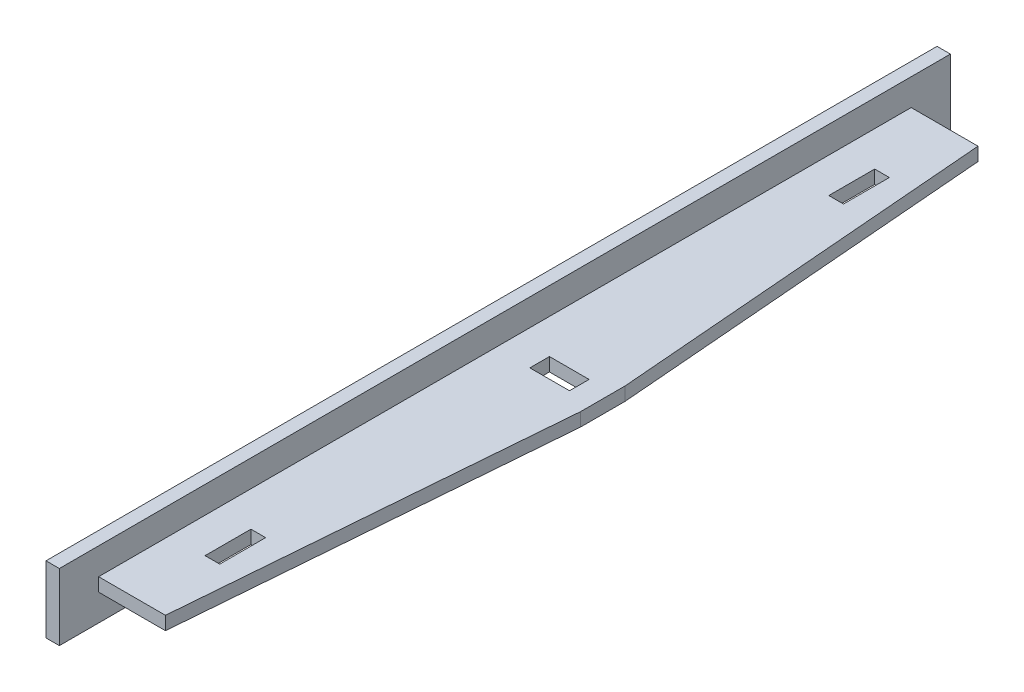
ISO-10303-21;
HEADER;
FILE_DESCRIPTION(('STEP AP214'),'2;1');
FILE_NAME('part.step','',(''),(''),'','','');
FILE_SCHEMA(('AUTOMOTIVE_DESIGN { 1 0 10303 214 1 1 1 1 }'));
ENDSEC;
DATA;
#1=APPLICATION_CONTEXT('core data for automotive mechanical design processes');
#2=APPLICATION_PROTOCOL_DEFINITION('international standard','automotive_design',2000,#1);
#3=PRODUCT_CONTEXT('',#1,'mechanical');
#4=PRODUCT('Part','Part','',(#3));
#5=PRODUCT_RELATED_PRODUCT_CATEGORY('part','',(#4));
#6=PRODUCT_DEFINITION_FORMATION('','',#4);
#7=PRODUCT_DEFINITION_CONTEXT('part definition',#1,'design');
#8=PRODUCT_DEFINITION('design','',#6,#7);
#9=PRODUCT_DEFINITION_SHAPE('','',#8);
#10=(LENGTH_UNIT() NAMED_UNIT(*) SI_UNIT(.MILLI.,.METRE.));
#11=(NAMED_UNIT(*) PLANE_ANGLE_UNIT() SI_UNIT($,.RADIAN.));
#12=(NAMED_UNIT(*) SI_UNIT($,.STERADIAN.) SOLID_ANGLE_UNIT());
#13=UNCERTAINTY_MEASURE_WITH_UNIT(LENGTH_MEASURE(1.E-05),#10,'distance_accuracy_value','');
#14=(GEOMETRIC_REPRESENTATION_CONTEXT(3) GLOBAL_UNCERTAINTY_ASSIGNED_CONTEXT((#13)) GLOBAL_UNIT_ASSIGNED_CONTEXT((#10,
#11,#12)) REPRESENTATION_CONTEXT('',''));
#15=CARTESIAN_POINT('',(0.,0.,0.));
#16=DIRECTION('',(0.,0.,1.));
#17=DIRECTION('',(1.,0.,0.));
#18=AXIS2_PLACEMENT_3D('',#15,#16,#17);
#19=CARTESIAN_POINT('',(0.,6.,0.));
#20=DIRECTION('',(0.,1.,0.));
#21=DIRECTION('',(0.,0.,1.));
#22=AXIS2_PLACEMENT_3D('',#19,#20,#21);
#23=PLANE('',#22);
#24=DIRECTION('',(0.,0.,1.));
#25=VECTOR('',#24,1.);
#26=CARTESIAN_POINT('',(10.85,6.,0.));
#27=LINE('',#26,#25);
#28=CARTESIAN_POINT('',(10.85,6.,164.849983771439));
#29=VERTEX_POINT('',#28);
#30=CARTESIAN_POINT('',(10.85,6.,175.149983771439));
#31=VERTEX_POINT('',#30);
#32=EDGE_CURVE('E66',#29,#31,#27,.T.);
#33=ORIENTED_EDGE('',*,*,#32,.T.);
#34=DIRECTION('',(1.,0.,0.));
#35=VECTOR('',#34,1.);
#36=CARTESIAN_POINT('',(0.,6.,175.149983771439));
#37=LINE('',#36,#35);
#38=CARTESIAN_POINT('',(14.15,6.,175.149983771439));
#39=VERTEX_POINT('',#38);
#40=EDGE_CURVE('E226',#31,#39,#37,.T.);
#41=ORIENTED_EDGE('',*,*,#40,.T.);
#42=DIRECTION('',(0.,0.,1.));
#43=VECTOR('',#42,1.);
#44=CARTESIAN_POINT('',(14.15,6.,0.));
#45=LINE('',#44,#43);
#46=CARTESIAN_POINT('',(14.15,6.,164.849983771439));
#47=VERTEX_POINT('',#46);
#48=EDGE_CURVE('E236',#47,#39,#45,.T.);
#49=ORIENTED_EDGE('',*,*,#48,.F.);
#50=DIRECTION('',(1.,0.,0.));
#51=VECTOR('',#50,1.);
#52=CARTESIAN_POINT('',(0.,6.,164.849983771439));
#53=LINE('',#52,#51);
#54=EDGE_CURVE('E239',#29,#47,#53,.T.);
#55=ORIENTED_EDGE('',*,*,#54,.F.);
#56=EDGE_LOOP('',(#33,#41,#49,#55));
#57=FACE_BOUND('',#56,.T.);
#58=DIRECTION('',(1.,0.,0.));
#59=VECTOR('',#58,1.);
#60=CARTESIAN_POINT('',(10.8,6.,97.7999837714389));
#61=LINE('',#60,#59);
#62=CARTESIAN_POINT('',(10.8,6.,97.7999837714389));
#63=VERTEX_POINT('',#62);
#64=CARTESIAN_POINT('',(19.7,6.,97.7999837714389));
#65=VERTEX_POINT('',#64);
#66=EDGE_CURVE('E258',#63,#65,#61,.T.);
#67=ORIENTED_EDGE('',*,*,#66,.F.);
#68=DIRECTION('',(0.,0.,-1.));
#69=VECTOR('',#68,1.);
#70=CARTESIAN_POINT('',(10.8,6.,102.199983771439));
#71=LINE('',#70,#69);
#72=CARTESIAN_POINT('',(10.8,6.,102.199983771439));
#73=VERTEX_POINT('',#72);
#74=EDGE_CURVE('E233',#73,#63,#71,.T.);
#75=ORIENTED_EDGE('',*,*,#74,.F.);
#76=DIRECTION('',(1.,0.,0.));
#77=VECTOR('',#76,1.);
#78=CARTESIAN_POINT('',(10.8,6.,102.199983771439));
#79=LINE('',#78,#77);
#80=CARTESIAN_POINT('',(19.7,6.,102.199983771439));
#81=VERTEX_POINT('',#80);
#82=EDGE_CURVE('E246',#73,#81,#79,.T.);
#83=ORIENTED_EDGE('',*,*,#82,.T.);
#84=DIRECTION('',(0.,0.,-1.));
#85=VECTOR('',#84,1.);
#86=CARTESIAN_POINT('',(19.7,6.,102.199983771439));
#87=LINE('',#86,#85);
#88=EDGE_CURVE('E255',#81,#65,#87,.T.);
#89=ORIENTED_EDGE('',*,*,#88,.T.);
#90=EDGE_LOOP('',(#67,#75,#83,#89));
#91=FACE_BOUND('',#90,.T.);
#92=DIRECTION('',(0.,0.,1.));
#93=VECTOR('',#92,1.);
#94=CARTESIAN_POINT('',(3.,6.,8.80998377143878));
#95=LINE('',#94,#93);
#96=CARTESIAN_POINT('',(3.,6.,8.80998377143878));
#97=VERTEX_POINT('',#96);
#98=CARTESIAN_POINT('',(3.,6.,191.190016228561));
#99=VERTEX_POINT('',#98);
#100=EDGE_CURVE('E262',#97,#99,#95,.T.);
#101=ORIENTED_EDGE('',*,*,#100,.F.);
#102=DIRECTION('',(-1.,0.,0.));
#103=VECTOR('',#102,1.);
#104=CARTESIAN_POINT('',(3.,6.,8.80998377143878));
#105=LINE('',#104,#103);
#106=CARTESIAN_POINT('',(18.,6.,8.80998377143878));
#107=VERTEX_POINT('',#106);
#108=EDGE_CURVE('E278',#107,#97,#105,.T.);
#109=ORIENTED_EDGE('',*,*,#108,.F.);
#110=DIRECTION('',(-0.0809493698714183,0.,-0.996718214701337));
#111=VECTOR('',#110,1.);
#112=CARTESIAN_POINT('',(18.,6.,8.80998377143878));
#113=LINE('',#112,#111);
#114=CARTESIAN_POINT('',(25.,6.,95.));
#115=VERTEX_POINT('',#114);
#116=EDGE_CURVE('E275',#115,#107,#113,.T.);
#117=ORIENTED_EDGE('',*,*,#116,.F.);
#118=DIRECTION('',(0.,0.,-1.));
#119=VECTOR('',#118,1.);
#120=CARTESIAN_POINT('',(25.,6.,95.));
#121=LINE('',#120,#119);
#122=CARTESIAN_POINT('',(25.,6.,105.));
#123=VERTEX_POINT('',#122);
#124=EDGE_CURVE('E272',#123,#115,#121,.T.);
#125=ORIENTED_EDGE('',*,*,#124,.F.);
#126=DIRECTION('',(0.0809493698714183,0.,-0.996718214701337));
#127=VECTOR('',#126,1.);
#128=CARTESIAN_POINT('',(18.,6.,191.190016228561));
#129=LINE('',#128,#127);
#130=CARTESIAN_POINT('',(18.,6.,191.190016228561));
#131=VERTEX_POINT('',#130);
#132=EDGE_CURVE('E269',#131,#123,#129,.T.);
#133=ORIENTED_EDGE('',*,*,#132,.F.);
#134=DIRECTION('',(1.,0.,0.));
#135=VECTOR('',#134,1.);
#136=CARTESIAN_POINT('',(3.,6.,191.190016228561));
#137=LINE('',#136,#135);
#138=EDGE_CURVE('E265',#99,#131,#137,.T.);
#139=ORIENTED_EDGE('',*,*,#138,.F.);
#140=EDGE_LOOP('',(#101,#109,#117,#125,#133,#139));
#141=FACE_BOUND('',#140,.T.);
#142=DIRECTION('',(0.,0.,-1.));
#143=VECTOR('',#142,1.);
#144=CARTESIAN_POINT('',(14.15,6.,0.));
#145=LINE('',#144,#143);
#146=CARTESIAN_POINT('',(14.15,6.,35.1499837714388));
#147=VERTEX_POINT('',#146);
#148=CARTESIAN_POINT('',(14.15,6.,24.8499837714389));
#149=VERTEX_POINT('',#148);
#150=EDGE_CURVE('E58',#147,#149,#145,.T.);
#151=ORIENTED_EDGE('',*,*,#150,.T.);
#152=DIRECTION('',(1.,0.,0.));
#153=VECTOR('',#152,1.);
#154=CARTESIAN_POINT('',(0.,6.,24.8499837714389));
#155=LINE('',#154,#153);
#156=CARTESIAN_POINT('',(10.85,6.,24.8499837714389));
#157=VERTEX_POINT('',#156);
#158=EDGE_CURVE('E214',#157,#149,#155,.T.);
#159=ORIENTED_EDGE('',*,*,#158,.F.);
#160=DIRECTION('',(0.,0.,-1.));
#161=VECTOR('',#160,1.);
#162=CARTESIAN_POINT('',(10.85,6.,0.));
#163=LINE('',#162,#161);
#164=CARTESIAN_POINT('',(10.85,6.,35.1499837714388));
#165=VERTEX_POINT('',#164);
#166=EDGE_CURVE('E199',#165,#157,#163,.T.);
#167=ORIENTED_EDGE('',*,*,#166,.F.);
#168=DIRECTION('',(1.,0.,0.));
#169=VECTOR('',#168,1.);
#170=CARTESIAN_POINT('',(0.,6.,35.1499837714388));
#171=LINE('',#170,#169);
#172=EDGE_CURVE('E209',#165,#147,#171,.T.);
#173=ORIENTED_EDGE('',*,*,#172,.T.);
#174=EDGE_LOOP('',(#151,#159,#167,#173));
#175=FACE_BOUND('',#174,.T.);
#176=ADVANCED_FACE('F43',(#57,#91,#141,#175),#23,.F.);
#177=CARTESIAN_POINT('',(0.,9.,0.));
#178=DIRECTION('',(0.,1.,0.));
#179=DIRECTION('',(0.,0.,1.));
#180=AXIS2_PLACEMENT_3D('',#177,#178,#179);
#181=PLANE('',#180);
#182=DIRECTION('',(0.,0.,1.));
#183=VECTOR('',#182,1.);
#184=CARTESIAN_POINT('',(10.8,9.,0.));
#185=LINE('',#184,#183);
#186=CARTESIAN_POINT('',(10.8,9.,97.7999837714389));
#187=VERTEX_POINT('',#186);
#188=CARTESIAN_POINT('',(10.8,9.,102.199983771439));
#189=VERTEX_POINT('',#188);
#190=EDGE_CURVE('E347',#187,#189,#185,.T.);
#191=ORIENTED_EDGE('',*,*,#190,.F.);
#192=DIRECTION('',(-1.,0.,0.));
#193=VECTOR('',#192,1.);
#194=CARTESIAN_POINT('',(0.,9.,97.7999837714389));
#195=LINE('',#194,#193);
#196=CARTESIAN_POINT('',(19.7,9.,97.7999837714389));
#197=VERTEX_POINT('',#196);
#198=EDGE_CURVE('E339',#197,#187,#195,.T.);
#199=ORIENTED_EDGE('',*,*,#198,.F.);
#200=DIRECTION('',(0.,0.,1.));
#201=VECTOR('',#200,1.);
#202=CARTESIAN_POINT('',(19.7,9.,0.));
#203=LINE('',#202,#201);
#204=CARTESIAN_POINT('',(19.7,9.,102.199983771439));
#205=VERTEX_POINT('',#204);
#206=EDGE_CURVE('E341',#197,#205,#203,.T.);
#207=ORIENTED_EDGE('',*,*,#206,.T.);
#208=DIRECTION('',(-1.,0.,0.));
#209=VECTOR('',#208,1.);
#210=CARTESIAN_POINT('',(0.,9.,102.199983771439));
#211=LINE('',#210,#209);
#212=EDGE_CURVE('E344',#205,#189,#211,.T.);
#213=ORIENTED_EDGE('',*,*,#212,.T.);
#214=EDGE_LOOP('',(#191,#199,#207,#213));
#215=FACE_BOUND('',#214,.T.);
#216=DIRECTION('',(0.,0.,1.));
#217=VECTOR('',#216,1.);
#218=CARTESIAN_POINT('',(3.,9.,8.80998377143878));
#219=LINE('',#218,#217);
#220=CARTESIAN_POINT('',(3.,9.,8.80998377143878));
#221=VERTEX_POINT('',#220);
#222=CARTESIAN_POINT('',(3.,9.,191.190016228561));
#223=VERTEX_POINT('',#222);
#224=EDGE_CURVE('E221',#221,#223,#219,.T.);
#225=ORIENTED_EDGE('',*,*,#224,.T.);
#226=DIRECTION('',(1.,0.,0.));
#227=VECTOR('',#226,1.);
#228=CARTESIAN_POINT('',(3.,9.,191.190016228561));
#229=LINE('',#228,#227);
#230=CARTESIAN_POINT('',(18.,9.,191.190016228561));
#231=VERTEX_POINT('',#230);
#232=EDGE_CURVE('E283',#223,#231,#229,.T.);
#233=ORIENTED_EDGE('',*,*,#232,.T.);
#234=DIRECTION('',(0.0809493698714183,0.,-0.996718214701337));
#235=VECTOR('',#234,1.);
#236=CARTESIAN_POINT('',(18.,9.,191.190016228561));
#237=LINE('',#236,#235);
#238=CARTESIAN_POINT('',(25.,9.,105.));
#239=VERTEX_POINT('',#238);
#240=EDGE_CURVE('E286',#231,#239,#237,.T.);
#241=ORIENTED_EDGE('',*,*,#240,.T.);
#242=DIRECTION('',(0.,0.,-1.));
#243=VECTOR('',#242,1.);
#244=CARTESIAN_POINT('',(25.,9.,95.));
#245=LINE('',#244,#243);
#246=CARTESIAN_POINT('',(25.,9.,95.));
#247=VERTEX_POINT('',#246);
#248=EDGE_CURVE('E289',#239,#247,#245,.T.);
#249=ORIENTED_EDGE('',*,*,#248,.T.);
#250=DIRECTION('',(-0.0809493698714183,0.,-0.996718214701337));
#251=VECTOR('',#250,1.);
#252=CARTESIAN_POINT('',(18.,9.,8.80998377143878));
#253=LINE('',#252,#251);
#254=CARTESIAN_POINT('',(18.,9.,8.80998377143878));
#255=VERTEX_POINT('',#254);
#256=EDGE_CURVE('E292',#247,#255,#253,.T.);
#257=ORIENTED_EDGE('',*,*,#256,.T.);
#258=DIRECTION('',(-1.,0.,0.));
#259=VECTOR('',#258,1.);
#260=CARTESIAN_POINT('',(3.,9.,8.80998377143878));
#261=LINE('',#260,#259);
#262=EDGE_CURVE('E266',#255,#221,#261,.T.);
#263=ORIENTED_EDGE('',*,*,#262,.T.);
#264=EDGE_LOOP('',(#225,#233,#241,#249,#257,#263));
#265=FACE_BOUND('',#264,.T.);
#266=DIRECTION('',(-1.,0.,0.));
#267=VECTOR('',#266,1.);
#268=CARTESIAN_POINT('',(0.,9.,175.149983771439));
#269=LINE('',#268,#267);
#270=CARTESIAN_POINT('',(14.15,9.,175.149983771439));
#271=VERTEX_POINT('',#270);
#272=CARTESIAN_POINT('',(10.85,9.,175.149983771439));
#273=VERTEX_POINT('',#272);
#274=EDGE_CURVE('E354',#271,#273,#269,.T.);
#275=ORIENTED_EDGE('',*,*,#274,.T.);
#276=DIRECTION('',(0.,0.,-1.));
#277=VECTOR('',#276,1.);
#278=CARTESIAN_POINT('',(10.85,9.,0.));
#279=LINE('',#278,#277);
#280=CARTESIAN_POINT('',(10.85,9.,164.849983771439));
#281=VERTEX_POINT('',#280);
#282=EDGE_CURVE('E357',#273,#281,#279,.T.);
#283=ORIENTED_EDGE('',*,*,#282,.T.);
#284=DIRECTION('',(-1.,0.,0.));
#285=VECTOR('',#284,1.);
#286=CARTESIAN_POINT('',(0.,9.,164.849983771439));
#287=LINE('',#286,#285);
#288=CARTESIAN_POINT('',(14.15,9.,164.849983771439));
#289=VERTEX_POINT('',#288);
#290=EDGE_CURVE('E349',#289,#281,#287,.T.);
#291=ORIENTED_EDGE('',*,*,#290,.F.);
#292=DIRECTION('',(0.,0.,-1.));
#293=VECTOR('',#292,1.);
#294=CARTESIAN_POINT('',(14.15,9.,0.));
#295=LINE('',#294,#293);
#296=EDGE_CURVE('E351',#271,#289,#295,.T.);
#297=ORIENTED_EDGE('',*,*,#296,.F.);
#298=EDGE_LOOP('',(#275,#283,#291,#297));
#299=FACE_BOUND('',#298,.T.);
#300=DIRECTION('',(-1.,0.,0.));
#301=VECTOR('',#300,1.);
#302=CARTESIAN_POINT('',(0.,9.,24.8499837714389));
#303=LINE('',#302,#301);
#304=CARTESIAN_POINT('',(14.15,9.,24.8499837714389));
#305=VERTEX_POINT('',#304);
#306=CARTESIAN_POINT('',(10.85,9.,24.8499837714389));
#307=VERTEX_POINT('',#306);
#308=EDGE_CURVE('E51',#305,#307,#303,.T.);
#309=ORIENTED_EDGE('',*,*,#308,.F.);
#310=DIRECTION('',(0.,0.,1.));
#311=VECTOR('',#310,1.);
#312=CARTESIAN_POINT('',(14.15,9.,0.));
#313=LINE('',#312,#311);
#314=CARTESIAN_POINT('',(14.15,9.,35.1499837714388));
#315=VERTEX_POINT('',#314);
#316=EDGE_CURVE('E11',#305,#315,#313,.T.);
#317=ORIENTED_EDGE('',*,*,#316,.T.);
#318=DIRECTION('',(-1.,0.,0.));
#319=VECTOR('',#318,1.);
#320=CARTESIAN_POINT('',(0.,9.,35.1499837714388));
#321=LINE('',#320,#319);
#322=CARTESIAN_POINT('',(10.85,9.,35.1499837714388));
#323=VERTEX_POINT('',#322);
#324=EDGE_CURVE('E360',#315,#323,#321,.T.);
#325=ORIENTED_EDGE('',*,*,#324,.T.);
#326=DIRECTION('',(0.,0.,1.));
#327=VECTOR('',#326,1.);
#328=CARTESIAN_POINT('',(10.85,9.,0.));
#329=LINE('',#328,#327);
#330=EDGE_CURVE('E202',#307,#323,#329,.T.);
#331=ORIENTED_EDGE('',*,*,#330,.F.);
#332=EDGE_LOOP('',(#309,#317,#325,#331));
#333=FACE_BOUND('',#332,.T.);
#334=ADVANCED_FACE('F367',(#215,#265,#299,#333),#181,.T.);
#335=CARTESIAN_POINT('',(3.,0.,200.));
#336=DIRECTION('',(-1.,0.,0.));
#337=DIRECTION('',(0.,0.,1.));
#338=AXIS2_PLACEMENT_3D('',#335,#336,#337);
#339=PLANE('',#338);
#340=DIRECTION('',(0.,1.,0.));
#341=VECTOR('',#340,1.);
#342=CARTESIAN_POINT('',(3.,0.,0.));
#343=LINE('',#342,#341);
#344=CARTESIAN_POINT('',(3.,0.,0.));
#345=VERTEX_POINT('',#344);
#346=CARTESIAN_POINT('',(3.,15.,0.));
#347=VERTEX_POINT('',#346);
#348=EDGE_CURVE('E325',#345,#347,#343,.T.);
#349=ORIENTED_EDGE('',*,*,#348,.T.);
#350=DIRECTION('',(0.,0.,-1.));
#351=VECTOR('',#350,1.);
#352=CARTESIAN_POINT('',(3.,15.,200.));
#353=LINE('',#352,#351);
#354=CARTESIAN_POINT('',(3.,15.,200.));
#355=VERTEX_POINT('',#354);
#356=EDGE_CURVE('E330',#355,#347,#353,.T.);
#357=ORIENTED_EDGE('',*,*,#356,.F.);
#358=DIRECTION('',(0.,1.,0.));
#359=VECTOR('',#358,1.);
#360=CARTESIAN_POINT('',(3.,0.,200.));
#361=LINE('',#360,#359);
#362=CARTESIAN_POINT('',(3.,0.,200.));
#363=VERTEX_POINT('',#362);
#364=EDGE_CURVE('E316',#363,#355,#361,.T.);
#365=ORIENTED_EDGE('',*,*,#364,.F.);
#366=DIRECTION('',(0.,0.,-1.));
#367=VECTOR('',#366,1.);
#368=CARTESIAN_POINT('',(3.,0.,200.));
#369=LINE('',#368,#367);
#370=EDGE_CURVE('E333',#363,#345,#369,.T.);
#371=ORIENTED_EDGE('',*,*,#370,.T.);
#372=EDGE_LOOP('',(#349,#357,#365,#371));
#373=FACE_BOUND('',#372,.T.);
#374=ORIENTED_EDGE('',*,*,#224,.F.);
#375=DIRECTION('',(0.,1.,0.));
#376=VECTOR('',#375,1.);
#377=CARTESIAN_POINT('',(3.,6.,8.80998377143878));
#378=LINE('',#377,#376);
#379=EDGE_CURVE('E297',#97,#221,#378,.T.);
#380=ORIENTED_EDGE('',*,*,#379,.F.);
#381=ORIENTED_EDGE('',*,*,#100,.T.);
#382=DIRECTION('',(0.,1.,0.));
#383=VECTOR('',#382,1.);
#384=CARTESIAN_POINT('',(3.,6.,191.190016228561));
#385=LINE('',#384,#383);
#386=EDGE_CURVE('E281',#99,#223,#385,.T.);
#387=ORIENTED_EDGE('',*,*,#386,.T.);
#388=EDGE_LOOP('',(#374,#380,#381,#387));
#389=FACE_BOUND('',#388,.T.);
#390=ADVANCED_FACE('F389',(#373,#389),#339,.F.);
#391=CARTESIAN_POINT('',(0.,0.,200.));
#392=DIRECTION('',(1.,0.,0.));
#393=DIRECTION('',(0.,0.,-1.));
#394=AXIS2_PLACEMENT_3D('',#391,#392,#393);
#395=PLANE('',#394);
#396=DIRECTION('',(0.,-1.,0.));
#397=VECTOR('',#396,1.);
#398=CARTESIAN_POINT('',(0.,0.,0.));
#399=LINE('',#398,#397);
#400=CARTESIAN_POINT('',(0.,15.,0.));
#401=VERTEX_POINT('',#400);
#402=CARTESIAN_POINT('',(0.,0.,0.));
#403=VERTEX_POINT('',#402);
#404=EDGE_CURVE('E299',#401,#403,#399,.T.);
#405=ORIENTED_EDGE('',*,*,#404,.T.);
#406=DIRECTION('',(0.,0.,-1.));
#407=VECTOR('',#406,1.);
#408=CARTESIAN_POINT('',(0.,0.,200.));
#409=LINE('',#408,#407);
#410=CARTESIAN_POINT('',(0.,0.,200.));
#411=VERTEX_POINT('',#410);
#412=EDGE_CURVE('E336',#411,#403,#409,.T.);
#413=ORIENTED_EDGE('',*,*,#412,.F.);
#414=DIRECTION('',(0.,-1.,0.));
#415=VECTOR('',#414,1.);
#416=CARTESIAN_POINT('',(0.,0.,200.));
#417=LINE('',#416,#415);
#418=CARTESIAN_POINT('',(0.,15.,200.));
#419=VERTEX_POINT('',#418);
#420=EDGE_CURVE('E310',#419,#411,#417,.T.);
#421=ORIENTED_EDGE('',*,*,#420,.F.);
#422=DIRECTION('',(0.,0.,-1.));
#423=VECTOR('',#422,1.);
#424=CARTESIAN_POINT('',(0.,15.,200.));
#425=LINE('',#424,#423);
#426=EDGE_CURVE('E320',#419,#401,#425,.T.);
#427=ORIENTED_EDGE('',*,*,#426,.T.);
#428=EDGE_LOOP('',(#405,#413,#421,#427));
#429=FACE_BOUND('',#428,.T.);
#430=ADVANCED_FACE('F45',(#429),#395,.F.);
#431=CARTESIAN_POINT('',(0.,0.,200.));
#432=DIRECTION('',(0.,1.,0.));
#433=DIRECTION('',(0.,0.,1.));
#434=AXIS2_PLACEMENT_3D('',#431,#432,#433);
#435=PLANE('',#434);
#436=DIRECTION('',(1.,0.,0.));
#437=VECTOR('',#436,1.);
#438=CARTESIAN_POINT('',(0.,0.,0.));
#439=LINE('',#438,#437);
#440=EDGE_CURVE('E323',#403,#345,#439,.T.);
#441=ORIENTED_EDGE('',*,*,#440,.T.);
#442=ORIENTED_EDGE('',*,*,#370,.F.);
#443=DIRECTION('',(1.,0.,0.));
#444=VECTOR('',#443,1.);
#445=CARTESIAN_POINT('',(0.,0.,200.));
#446=LINE('',#445,#444);
#447=EDGE_CURVE('E313',#411,#363,#446,.T.);
#448=ORIENTED_EDGE('',*,*,#447,.F.);
#449=ORIENTED_EDGE('',*,*,#412,.T.);
#450=EDGE_LOOP('',(#441,#442,#448,#449));
#451=FACE_BOUND('',#450,.T.);
#452=ADVANCED_FACE('F428',(#451),#435,.F.);
#453=CARTESIAN_POINT('',(0.,15.,200.));
#454=DIRECTION('',(0.,-1.,0.));
#455=DIRECTION('',(0.,0.,-1.));
#456=AXIS2_PLACEMENT_3D('',#453,#454,#455);
#457=PLANE('',#456);
#458=DIRECTION('',(-1.,0.,0.));
#459=VECTOR('',#458,1.);
#460=CARTESIAN_POINT('',(0.,15.,0.));
#461=LINE('',#460,#459);
#462=EDGE_CURVE('E314',#347,#401,#461,.T.);
#463=ORIENTED_EDGE('',*,*,#462,.T.);
#464=ORIENTED_EDGE('',*,*,#426,.F.);
#465=DIRECTION('',(-1.,0.,0.));
#466=VECTOR('',#465,1.);
#467=CARTESIAN_POINT('',(0.,15.,200.));
#468=LINE('',#467,#466);
#469=EDGE_CURVE('E318',#355,#419,#468,.T.);
#470=ORIENTED_EDGE('',*,*,#469,.F.);
#471=ORIENTED_EDGE('',*,*,#356,.T.);
#472=EDGE_LOOP('',(#463,#464,#470,#471));
#473=FACE_BOUND('',#472,.T.);
#474=ADVANCED_FACE('F421',(#473),#457,.F.);
#475=CARTESIAN_POINT('',(0.,0.,200.));
#476=DIRECTION('',(0.,0.,-1.));
#477=DIRECTION('',(-1.,0.,0.));
#478=AXIS2_PLACEMENT_3D('',#475,#476,#477);
#479=PLANE('',#478);
#480=ORIENTED_EDGE('',*,*,#420,.T.);
#481=ORIENTED_EDGE('',*,*,#447,.T.);
#482=ORIENTED_EDGE('',*,*,#364,.T.);
#483=ORIENTED_EDGE('',*,*,#469,.T.);
#484=EDGE_LOOP('',(#480,#481,#482,#483));
#485=FACE_BOUND('',#484,.T.);
#486=ADVANCED_FACE('F418',(#485),#479,.F.);
#487=CARTESIAN_POINT('',(0.,0.,0.));
#488=DIRECTION('',(0.,0.,-1.));
#489=DIRECTION('',(-1.,0.,0.));
#490=AXIS2_PLACEMENT_3D('',#487,#488,#489);
#491=PLANE('',#490);
#492=ORIENTED_EDGE('',*,*,#404,.F.);
#493=ORIENTED_EDGE('',*,*,#462,.F.);
#494=ORIENTED_EDGE('',*,*,#348,.F.);
#495=ORIENTED_EDGE('',*,*,#440,.F.);
#496=EDGE_LOOP('',(#492,#493,#494,#495));
#497=FACE_BOUND('',#496,.T.);
#498=ADVANCED_FACE('F401',(#497),#491,.T.);
#499=CARTESIAN_POINT('',(3.,6.,8.80998377143878));
#500=DIRECTION('',(0.,0.,-1.));
#501=DIRECTION('',(-1.,0.,0.));
#502=AXIS2_PLACEMENT_3D('',#499,#500,#501);
#503=PLANE('',#502);
#504=ORIENTED_EDGE('',*,*,#262,.F.);
#505=DIRECTION('',(0.,1.,0.));
#506=VECTOR('',#505,1.);
#507=CARTESIAN_POINT('',(18.,6.,8.80998377143878));
#508=LINE('',#507,#506);
#509=EDGE_CURVE('E300',#107,#255,#508,.T.);
#510=ORIENTED_EDGE('',*,*,#509,.F.);
#511=ORIENTED_EDGE('',*,*,#108,.T.);
#512=ORIENTED_EDGE('',*,*,#379,.T.);
#513=EDGE_LOOP('',(#504,#510,#511,#512));
#514=FACE_BOUND('',#513,.T.);
#515=ADVANCED_FACE('F397',(#514),#503,.T.);
#516=CARTESIAN_POINT('',(18.,6.,8.80998377143878));
#517=DIRECTION('',(0.996718214701337,0.,-0.0809493698714183));
#518=DIRECTION('',(-0.0809493698714183,0.,-0.996718214701337));
#519=AXIS2_PLACEMENT_3D('',#516,#517,#518);
#520=PLANE('',#519);
#521=ORIENTED_EDGE('',*,*,#256,.F.);
#522=DIRECTION('',(0.,1.,0.));
#523=VECTOR('',#522,1.);
#524=CARTESIAN_POINT('',(25.,6.,95.));
#525=LINE('',#524,#523);
#526=EDGE_CURVE('E302',#115,#247,#525,.T.);
#527=ORIENTED_EDGE('',*,*,#526,.F.);
#528=ORIENTED_EDGE('',*,*,#116,.T.);
#529=ORIENTED_EDGE('',*,*,#509,.T.);
#530=EDGE_LOOP('',(#521,#527,#528,#529));
#531=FACE_BOUND('',#530,.T.);
#532=ADVANCED_FACE('F400',(#531),#520,.T.);
#533=CARTESIAN_POINT('',(25.,6.,95.));
#534=DIRECTION('',(1.,0.,0.));
#535=DIRECTION('',(0.,0.,-1.));
#536=AXIS2_PLACEMENT_3D('',#533,#534,#535);
#537=PLANE('',#536);
#538=ORIENTED_EDGE('',*,*,#248,.F.);
#539=DIRECTION('',(0.,1.,0.));
#540=VECTOR('',#539,1.);
#541=CARTESIAN_POINT('',(25.,6.,105.));
#542=LINE('',#541,#540);
#543=EDGE_CURVE('E304',#123,#239,#542,.T.);
#544=ORIENTED_EDGE('',*,*,#543,.F.);
#545=ORIENTED_EDGE('',*,*,#124,.T.);
#546=ORIENTED_EDGE('',*,*,#526,.T.);
#547=EDGE_LOOP('',(#538,#544,#545,#546));
#548=FACE_BOUND('',#547,.T.);
#549=ADVANCED_FACE('F405',(#548),#537,.T.);
#550=CARTESIAN_POINT('',(18.,6.,191.190016228561));
#551=DIRECTION('',(0.996718214701337,0.,0.0809493698714183));
#552=DIRECTION('',(0.0809493698714184,0.,-0.996718214701337));
#553=AXIS2_PLACEMENT_3D('',#550,#551,#552);
#554=PLANE('',#553);
#555=ORIENTED_EDGE('',*,*,#240,.F.);
#556=DIRECTION('',(0.,1.,0.));
#557=VECTOR('',#556,1.);
#558=CARTESIAN_POINT('',(18.,6.,191.190016228561));
#559=LINE('',#558,#557);
#560=EDGE_CURVE('E306',#131,#231,#559,.T.);
#561=ORIENTED_EDGE('',*,*,#560,.F.);
#562=ORIENTED_EDGE('',*,*,#132,.T.);
#563=ORIENTED_EDGE('',*,*,#543,.T.);
#564=EDGE_LOOP('',(#555,#561,#562,#563));
#565=FACE_BOUND('',#564,.T.);
#566=ADVANCED_FACE('F409',(#565),#554,.T.);
#567=CARTESIAN_POINT('',(3.,6.,191.190016228561));
#568=DIRECTION('',(0.,0.,1.));
#569=DIRECTION('',(1.,0.,0.));
#570=AXIS2_PLACEMENT_3D('',#567,#568,#569);
#571=PLANE('',#570);
#572=ORIENTED_EDGE('',*,*,#232,.F.);
#573=ORIENTED_EDGE('',*,*,#386,.F.);
#574=ORIENTED_EDGE('',*,*,#138,.T.);
#575=ORIENTED_EDGE('',*,*,#560,.T.);
#576=EDGE_LOOP('',(#572,#573,#574,#575));
#577=FACE_BOUND('',#576,.T.);
#578=ADVANCED_FACE('F413',(#577),#571,.T.);
#579=CARTESIAN_POINT('',(10.8,16.,102.199983771439));
#580=DIRECTION('',(-1.,0.,0.));
#581=DIRECTION('',(0.,0.,1.));
#582=AXIS2_PLACEMENT_3D('',#579,#580,#581);
#583=PLANE('',#582);
#584=ORIENTED_EDGE('',*,*,#190,.T.);
#585=DIRECTION('',(0.,-1.,0.));
#586=VECTOR('',#585,1.);
#587=CARTESIAN_POINT('',(10.8,16.,102.199983771439));
#588=LINE('',#587,#586);
#589=EDGE_CURVE('E251',#189,#73,#588,.T.);
#590=ORIENTED_EDGE('',*,*,#589,.T.);
#591=ORIENTED_EDGE('',*,*,#74,.T.);
#592=DIRECTION('',(0.,-1.,0.));
#593=VECTOR('',#592,1.);
#594=CARTESIAN_POINT('',(10.8,16.,97.7999837714389));
#595=LINE('',#594,#593);
#596=EDGE_CURVE('E243',#187,#63,#595,.T.);
#597=ORIENTED_EDGE('',*,*,#596,.F.);
#598=EDGE_LOOP('',(#584,#590,#591,#597));
#599=FACE_BOUND('',#598,.T.);
#600=ADVANCED_FACE('F416',(#599),#583,.F.);
#601=CARTESIAN_POINT('',(10.8,16.,102.199983771439));
#602=DIRECTION('',(0.,0.,-1.));
#603=DIRECTION('',(-1.,0.,0.));
#604=AXIS2_PLACEMENT_3D('',#601,#602,#603);
#605=PLANE('',#604);
#606=DIRECTION('',(0.,-1.,0.));
#607=VECTOR('',#606,1.);
#608=CARTESIAN_POINT('',(19.7,16.,102.199983771439));
#609=LINE('',#608,#607);
#610=EDGE_CURVE('E249',#205,#81,#609,.T.);
#611=ORIENTED_EDGE('',*,*,#610,.T.);
#612=ORIENTED_EDGE('',*,*,#82,.F.);
#613=ORIENTED_EDGE('',*,*,#589,.F.);
#614=ORIENTED_EDGE('',*,*,#212,.F.);
#615=EDGE_LOOP('',(#611,#612,#613,#614));
#616=FACE_BOUND('',#615,.T.);
#617=ADVANCED_FACE('F394',(#616),#605,.T.);
#618=CARTESIAN_POINT('',(19.7,16.,102.199983771439));
#619=DIRECTION('',(-1.,0.,0.));
#620=DIRECTION('',(0.,0.,1.));
#621=AXIS2_PLACEMENT_3D('',#618,#619,#620);
#622=PLANE('',#621);
#623=DIRECTION('',(0.,-1.,0.));
#624=VECTOR('',#623,1.);
#625=CARTESIAN_POINT('',(19.7,16.,97.7999837714389));
#626=LINE('',#625,#624);
#627=EDGE_CURVE('E247',#197,#65,#626,.T.);
#628=ORIENTED_EDGE('',*,*,#627,.T.);
#629=ORIENTED_EDGE('',*,*,#88,.F.);
#630=ORIENTED_EDGE('',*,*,#610,.F.);
#631=ORIENTED_EDGE('',*,*,#206,.F.);
#632=EDGE_LOOP('',(#628,#629,#630,#631));
#633=FACE_BOUND('',#632,.T.);
#634=ADVANCED_FACE('F482',(#633),#622,.T.);
#635=CARTESIAN_POINT('',(10.8,16.,97.7999837714389));
#636=DIRECTION('',(0.,0.,-1.));
#637=DIRECTION('',(-1.,0.,0.));
#638=AXIS2_PLACEMENT_3D('',#635,#636,#637);
#639=PLANE('',#638);
#640=ORIENTED_EDGE('',*,*,#198,.T.);
#641=ORIENTED_EDGE('',*,*,#596,.T.);
#642=ORIENTED_EDGE('',*,*,#66,.T.);
#643=ORIENTED_EDGE('',*,*,#627,.F.);
#644=EDGE_LOOP('',(#640,#641,#642,#643));
#645=FACE_BOUND('',#644,.T.);
#646=ADVANCED_FACE('F476',(#645),#639,.F.);
#647=CARTESIAN_POINT('',(10.85,16.,0.));
#648=DIRECTION('',(1.,0.,0.));
#649=DIRECTION('',(0.,0.,-1.));
#650=AXIS2_PLACEMENT_3D('',#647,#648,#649);
#651=PLANE('',#650);
#652=DIRECTION('',(0.,-1.,0.));
#653=VECTOR('',#652,1.);
#654=CARTESIAN_POINT('',(10.85,16.,175.149983771439));
#655=LINE('',#654,#653);
#656=EDGE_CURVE('E231',#273,#31,#655,.T.);
#657=ORIENTED_EDGE('',*,*,#656,.T.);
#658=ORIENTED_EDGE('',*,*,#32,.F.);
#659=DIRECTION('',(0.,-1.,0.));
#660=VECTOR('',#659,1.);
#661=CARTESIAN_POINT('',(10.85,16.,164.849983771439));
#662=LINE('',#661,#660);
#663=EDGE_CURVE('E224',#281,#29,#662,.T.);
#664=ORIENTED_EDGE('',*,*,#663,.F.);
#665=ORIENTED_EDGE('',*,*,#282,.F.);
#666=EDGE_LOOP('',(#657,#658,#664,#665));
#667=FACE_BOUND('',#666,.T.);
#668=ADVANCED_FACE('F474',(#667),#651,.T.);
#669=CARTESIAN_POINT('',(0.,16.,175.149983771439));
#670=DIRECTION('',(0.,0.,-1.));
#671=DIRECTION('',(-1.,0.,0.));
#672=AXIS2_PLACEMENT_3D('',#669,#670,#671);
#673=PLANE('',#672);
#674=DIRECTION('',(0.,-1.,0.));
#675=VECTOR('',#674,1.);
#676=CARTESIAN_POINT('',(14.15,16.,175.149983771439));
#677=LINE('',#676,#675);
#678=EDGE_CURVE('E229',#271,#39,#677,.T.);
#679=ORIENTED_EDGE('',*,*,#678,.T.);
#680=ORIENTED_EDGE('',*,*,#40,.F.);
#681=ORIENTED_EDGE('',*,*,#656,.F.);
#682=ORIENTED_EDGE('',*,*,#274,.F.);
#683=EDGE_LOOP('',(#679,#680,#681,#682));
#684=FACE_BOUND('',#683,.T.);
#685=ADVANCED_FACE('F469',(#684),#673,.T.);
#686=CARTESIAN_POINT('',(14.15,16.,0.));
#687=DIRECTION('',(1.,0.,0.));
#688=DIRECTION('',(0.,0.,-1.));
#689=AXIS2_PLACEMENT_3D('',#686,#687,#688);
#690=PLANE('',#689);
#691=ORIENTED_EDGE('',*,*,#296,.T.);
#692=DIRECTION('',(0.,-1.,0.));
#693=VECTOR('',#692,1.);
#694=CARTESIAN_POINT('',(14.15,16.,164.849983771439));
#695=LINE('',#694,#693);
#696=EDGE_CURVE('E227',#289,#47,#695,.T.);
#697=ORIENTED_EDGE('',*,*,#696,.T.);
#698=ORIENTED_EDGE('',*,*,#48,.T.);
#699=ORIENTED_EDGE('',*,*,#678,.F.);
#700=EDGE_LOOP('',(#691,#697,#698,#699));
#701=FACE_BOUND('',#700,.T.);
#702=ADVANCED_FACE('F377',(#701),#690,.F.);
#703=CARTESIAN_POINT('',(0.,16.,164.849983771439));
#704=DIRECTION('',(0.,0.,-1.));
#705=DIRECTION('',(-1.,0.,0.));
#706=AXIS2_PLACEMENT_3D('',#703,#704,#705);
#707=PLANE('',#706);
#708=ORIENTED_EDGE('',*,*,#290,.T.);
#709=ORIENTED_EDGE('',*,*,#663,.T.);
#710=ORIENTED_EDGE('',*,*,#54,.T.);
#711=ORIENTED_EDGE('',*,*,#696,.F.);
#712=EDGE_LOOP('',(#708,#709,#710,#711));
#713=FACE_BOUND('',#712,.T.);
#714=ADVANCED_FACE('F370',(#713),#707,.F.);
#715=CARTESIAN_POINT('',(14.15,16.,0.));
#716=DIRECTION('',(-1.,0.,0.));
#717=DIRECTION('',(0.,0.,1.));
#718=AXIS2_PLACEMENT_3D('',#715,#716,#717);
#719=PLANE('',#718);
#720=DIRECTION('',(0.,-1.,0.));
#721=VECTOR('',#720,1.);
#722=CARTESIAN_POINT('',(14.15,16.,24.8499837714389));
#723=LINE('',#722,#721);
#724=EDGE_CURVE('E219',#305,#149,#723,.T.);
#725=ORIENTED_EDGE('',*,*,#724,.T.);
#726=ORIENTED_EDGE('',*,*,#150,.F.);
#727=DIRECTION('',(0.,-1.,0.));
#728=VECTOR('',#727,1.);
#729=CARTESIAN_POINT('',(14.15,16.,35.1499837714388));
#730=LINE('',#729,#728);
#731=EDGE_CURVE('E206',#315,#147,#730,.T.);
#732=ORIENTED_EDGE('',*,*,#731,.F.);
#733=ORIENTED_EDGE('',*,*,#316,.F.);
#734=EDGE_LOOP('',(#725,#726,#732,#733));
#735=FACE_BOUND('',#734,.T.);
#736=ADVANCED_FACE('F368',(#735),#719,.T.);
#737=CARTESIAN_POINT('',(0.,16.,24.8499837714389));
#738=DIRECTION('',(0.,0.,-1.));
#739=DIRECTION('',(-1.,0.,0.));
#740=AXIS2_PLACEMENT_3D('',#737,#738,#739);
#741=PLANE('',#740);
#742=ORIENTED_EDGE('',*,*,#308,.T.);
#743=DIRECTION('',(0.,-1.,0.));
#744=VECTOR('',#743,1.);
#745=CARTESIAN_POINT('',(10.85,16.,24.8499837714389));
#746=LINE('',#745,#744);
#747=EDGE_CURVE('E205',#307,#157,#746,.T.);
#748=ORIENTED_EDGE('',*,*,#747,.T.);
#749=ORIENTED_EDGE('',*,*,#158,.T.);
#750=ORIENTED_EDGE('',*,*,#724,.F.);
#751=EDGE_LOOP('',(#742,#748,#749,#750));
#752=FACE_BOUND('',#751,.T.);
#753=ADVANCED_FACE('F365',(#752),#741,.F.);
#754=CARTESIAN_POINT('',(10.85,16.,0.));
#755=DIRECTION('',(-1.,0.,0.));
#756=DIRECTION('',(0.,0.,1.));
#757=AXIS2_PLACEMENT_3D('',#754,#755,#756);
#758=PLANE('',#757);
#759=ORIENTED_EDGE('',*,*,#330,.T.);
#760=DIRECTION('',(0.,-1.,0.));
#761=VECTOR('',#760,1.);
#762=CARTESIAN_POINT('',(10.85,16.,35.1499837714388));
#763=LINE('',#762,#761);
#764=EDGE_CURVE('E194',#323,#165,#763,.T.);
#765=ORIENTED_EDGE('',*,*,#764,.T.);
#766=ORIENTED_EDGE('',*,*,#166,.T.);
#767=ORIENTED_EDGE('',*,*,#747,.F.);
#768=EDGE_LOOP('',(#759,#765,#766,#767));
#769=FACE_BOUND('',#768,.T.);
#770=ADVANCED_FACE('F196',(#769),#758,.F.);
#771=CARTESIAN_POINT('',(0.,16.,35.1499837714388));
#772=DIRECTION('',(0.,0.,-1.));
#773=DIRECTION('',(-1.,0.,0.));
#774=AXIS2_PLACEMENT_3D('',#771,#772,#773);
#775=PLANE('',#774);
#776=ORIENTED_EDGE('',*,*,#731,.T.);
#777=ORIENTED_EDGE('',*,*,#172,.F.);
#778=ORIENTED_EDGE('',*,*,#764,.F.);
#779=ORIENTED_EDGE('',*,*,#324,.F.);
#780=EDGE_LOOP('',(#776,#777,#778,#779));
#781=FACE_BOUND('',#780,.T.);
#782=ADVANCED_FACE('F210',(#781),#775,.T.);
#783=CLOSED_SHELL('',(#176,#334,#390,#430,#452,#474,#486,#498,#515,#532,#549,#566,#578,#600,
#617,#634,#646,#668,#685,#702,#714,#736,#753,#770,#782));
#784=MANIFOLD_SOLID_BREP('B2',#783);
#785=ADVANCED_BREP_SHAPE_REPRESENTATION('',(#18,#784),#14);
#786=SHAPE_DEFINITION_REPRESENTATION(#9,#785);
ENDSEC;
END-ISO-10303-21;
